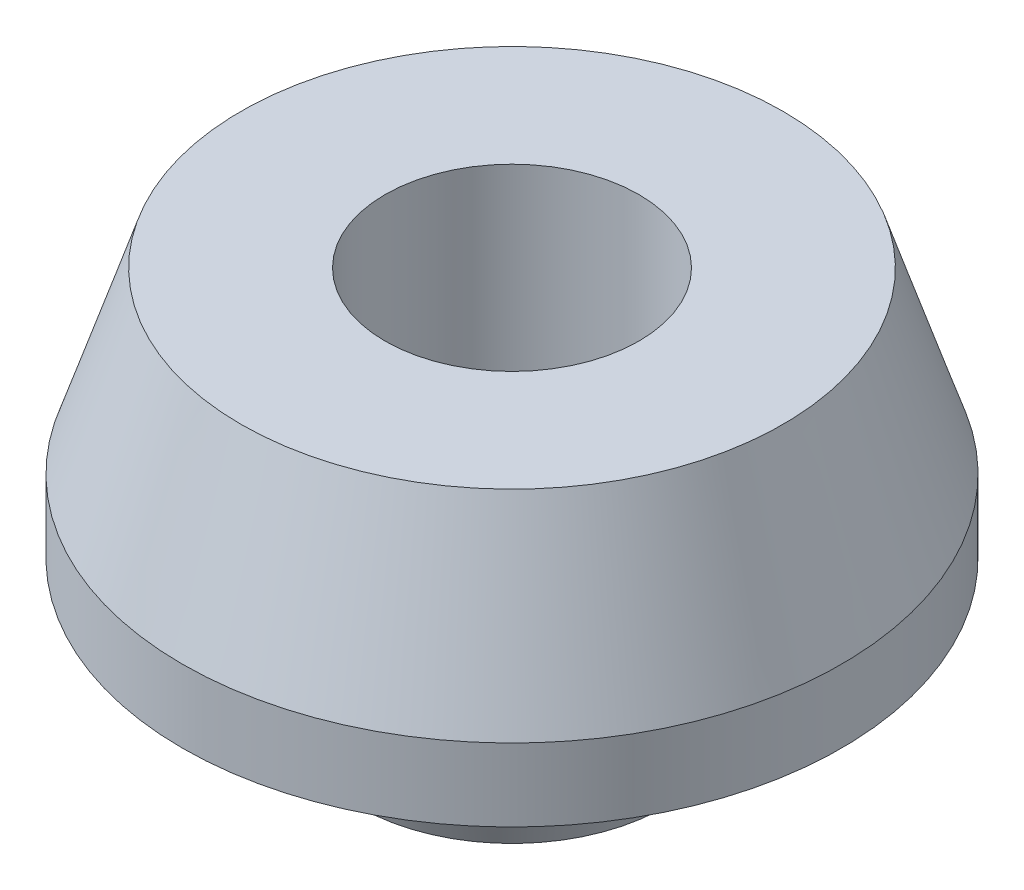
ISO-10303-21;
HEADER;
FILE_DESCRIPTION(('STEP AP214'),'2;1');
FILE_NAME('part.step','',(''),(''),'','','');
FILE_SCHEMA(('AUTOMOTIVE_DESIGN { 1 0 10303 214 1 1 1 1 }'));
ENDSEC;
DATA;
#1=APPLICATION_CONTEXT('core data for automotive mechanical design processes');
#2=APPLICATION_PROTOCOL_DEFINITION('international standard','automotive_design',2000,#1);
#3=PRODUCT_CONTEXT('',#1,'mechanical');
#4=PRODUCT('Part','Part','',(#3));
#5=PRODUCT_RELATED_PRODUCT_CATEGORY('part','',(#4));
#6=PRODUCT_DEFINITION_FORMATION('','',#4);
#7=PRODUCT_DEFINITION_CONTEXT('part definition',#1,'design');
#8=PRODUCT_DEFINITION('design','',#6,#7);
#9=PRODUCT_DEFINITION_SHAPE('','',#8);
#10=(LENGTH_UNIT() NAMED_UNIT(*) SI_UNIT(.MILLI.,.METRE.));
#11=(NAMED_UNIT(*) PLANE_ANGLE_UNIT() SI_UNIT($,.RADIAN.));
#12=(NAMED_UNIT(*) SI_UNIT($,.STERADIAN.) SOLID_ANGLE_UNIT());
#13=UNCERTAINTY_MEASURE_WITH_UNIT(LENGTH_MEASURE(1.E-05),#10,'distance_accuracy_value','');
#14=(GEOMETRIC_REPRESENTATION_CONTEXT(3) GLOBAL_UNCERTAINTY_ASSIGNED_CONTEXT((#13)) GLOBAL_UNIT_ASSIGNED_CONTEXT((#10,
#11,#12)) REPRESENTATION_CONTEXT('',''));
#15=CARTESIAN_POINT('',(0.,0.,0.));
#16=DIRECTION('',(0.,0.,1.));
#17=DIRECTION('',(1.,0.,0.));
#18=AXIS2_PLACEMENT_3D('',#15,#16,#17);
#19=CARTESIAN_POINT('',(5.8,0.,0.));
#20=DIRECTION('',(0.,-1.,0.));
#21=DIRECTION('',(0.,0.,-1.));
#22=AXIS2_PLACEMENT_3D('',#19,#20,#21);
#23=PLANE('',#22);
#24=CARTESIAN_POINT('',(0.,0.,0.));
#25=DIRECTION('',(0.,-1.,0.));
#26=DIRECTION('',(0.,0.,-1.));
#27=AXIS2_PLACEMENT_3D('',#24,#25,#26);
#28=CIRCLE('',#27,5.8);
#29=CARTESIAN_POINT('',(0.,0.,-5.8));
#30=VERTEX_POINT('',#29);
#31=EDGE_CURVE('E55',#30,#30,#28,.T.);
#32=ORIENTED_EDGE('',*,*,#31,.T.);
#33=EDGE_LOOP('',(#32));
#34=FACE_BOUND('',#33,.T.);
#35=CARTESIAN_POINT('',(0.,0.,0.));
#36=DIRECTION('',(0.,-1.,0.));
#37=DIRECTION('',(0.,0.,-1.));
#38=AXIS2_PLACEMENT_3D('',#35,#36,#37);
#39=CIRCLE('',#38,4.8);
#40=CARTESIAN_POINT('',(0.,0.,-4.8));
#41=VERTEX_POINT('',#40);
#42=EDGE_CURVE('E10',#41,#41,#39,.T.);
#43=ORIENTED_EDGE('',*,*,#42,.F.);
#44=EDGE_LOOP('',(#43));
#45=FACE_BOUND('',#44,.T.);
#46=ADVANCED_FACE('F30',(#34,#45),#23,.T.);
#47=CARTESIAN_POINT('',(0.,0.,0.));
#48=DIRECTION('',(0.,-1.,0.));
#49=DIRECTION('',(0.,0.,-1.));
#50=AXIS2_PLACEMENT_3D('',#47,#48,#49);
#51=CYLINDRICAL_SURFACE('',#50,4.8);
#52=ORIENTED_EDGE('',*,*,#42,.T.);
#53=EDGE_LOOP('',(#52));
#54=FACE_BOUND('',#53,.T.);
#55=CARTESIAN_POINT('',(0.,14.75,0.));
#56=DIRECTION('',(0.,-1.,0.));
#57=DIRECTION('',(0.,0.,-1.));
#58=AXIS2_PLACEMENT_3D('',#55,#56,#57);
#59=CIRCLE('',#58,4.8);
#60=CARTESIAN_POINT('',(0.,14.75,-4.8));
#61=VERTEX_POINT('',#60);
#62=EDGE_CURVE('E36',#61,#61,#59,.T.);
#63=ORIENTED_EDGE('',*,*,#62,.F.);
#64=EDGE_LOOP('',(#63));
#65=FACE_BOUND('',#64,.T.);
#66=ADVANCED_FACE('F73',(#54,#65),#51,.F.);
#67=CARTESIAN_POINT('',(4.8,14.75,0.));
#68=DIRECTION('',(0.,1.,0.));
#69=DIRECTION('',(0.,0.,1.));
#70=AXIS2_PLACEMENT_3D('',#67,#68,#69);
#71=PLANE('',#70);
#72=ORIENTED_EDGE('',*,*,#62,.T.);
#73=EDGE_LOOP('',(#72));
#74=FACE_BOUND('',#73,.T.);
#75=CARTESIAN_POINT('',(0.,14.75,0.));
#76=DIRECTION('',(0.,-1.,0.));
#77=DIRECTION('',(0.,0.,-1.));
#78=AXIS2_PLACEMENT_3D('',#75,#76,#77);
#79=CIRCLE('',#78,10.25);
#80=CARTESIAN_POINT('',(0.,14.75,-10.25));
#81=VERTEX_POINT('',#80);
#82=EDGE_CURVE('E40',#81,#81,#79,.T.);
#83=ORIENTED_EDGE('',*,*,#82,.F.);
#84=EDGE_LOOP('',(#83));
#85=FACE_BOUND('',#84,.T.);
#86=ADVANCED_FACE('F77',(#74,#85),#71,.T.);
#87=CARTESIAN_POINT('',(0.,8.,0.));
#88=DIRECTION('',(0.,-1.,0.));
#89=DIRECTION('',(0.,0.,-1.));
#90=AXIS2_PLACEMENT_3D('',#87,#88,#89);
#91=CONICAL_SURFACE('',#90,12.4608437298975,0.316520664516921);
#92=ORIENTED_EDGE('',*,*,#82,.T.);
#93=EDGE_LOOP('',(#92));
#94=FACE_BOUND('',#93,.T.);
#95=CARTESIAN_POINT('',(0.,8.,0.));
#96=DIRECTION('',(0.,-1.,0.));
#97=DIRECTION('',(0.,0.,-1.));
#98=AXIS2_PLACEMENT_3D('',#95,#96,#97);
#99=CIRCLE('',#98,12.4608437298975);
#100=CARTESIAN_POINT('',(0.,8.,-12.4608437298975));
#101=VERTEX_POINT('',#100);
#102=EDGE_CURVE('E44',#101,#101,#99,.T.);
#103=ORIENTED_EDGE('',*,*,#102,.F.);
#104=EDGE_LOOP('',(#103));
#105=FACE_BOUND('',#104,.T.);
#106=ADVANCED_FACE('F81',(#94,#105),#91,.T.);
#107=CARTESIAN_POINT('',(0.,0.,0.));
#108=DIRECTION('',(0.,-1.,0.));
#109=DIRECTION('',(0.,0.,-1.));
#110=AXIS2_PLACEMENT_3D('',#107,#108,#109);
#111=CYLINDRICAL_SURFACE('',#110,12.4608437298975);
#112=ORIENTED_EDGE('',*,*,#102,.T.);
#113=EDGE_LOOP('',(#112));
#114=FACE_BOUND('',#113,.T.);
#115=CARTESIAN_POINT('',(0.,5.25,0.));
#116=DIRECTION('',(0.,-1.,0.));
#117=DIRECTION('',(0.,0.,-1.));
#118=AXIS2_PLACEMENT_3D('',#115,#116,#117);
#119=CIRCLE('',#118,12.4608437298975);
#120=CARTESIAN_POINT('',(0.,5.25,-12.4608437298975));
#121=VERTEX_POINT('',#120);
#122=EDGE_CURVE('E49',#121,#121,#119,.T.);
#123=ORIENTED_EDGE('',*,*,#122,.F.);
#124=EDGE_LOOP('',(#123));
#125=FACE_BOUND('',#124,.T.);
#126=ADVANCED_FACE('F69',(#114,#125),#111,.T.);
#127=CARTESIAN_POINT('',(12.4608437298975,5.25,0.));
#128=DIRECTION('',(0.,-1.,0.));
#129=DIRECTION('',(0.,0.,-1.));
#130=AXIS2_PLACEMENT_3D('',#127,#128,#129);
#131=PLANE('',#130);
#132=ORIENTED_EDGE('',*,*,#122,.T.);
#133=EDGE_LOOP('',(#132));
#134=FACE_BOUND('',#133,.T.);
#135=CARTESIAN_POINT('',(0.,5.25,0.));
#136=DIRECTION('',(0.,-1.,0.));
#137=DIRECTION('',(0.,0.,-1.));
#138=AXIS2_PLACEMENT_3D('',#135,#136,#137);
#139=CIRCLE('',#138,7.71084372989754);
#140=CARTESIAN_POINT('',(0.,5.25,-7.71084372989754));
#141=VERTEX_POINT('',#140);
#142=EDGE_CURVE('E52',#141,#141,#139,.T.);
#143=ORIENTED_EDGE('',*,*,#142,.F.);
#144=EDGE_LOOP('',(#143));
#145=FACE_BOUND('',#144,.T.);
#146=ADVANCED_FACE('F63',(#134,#145),#131,.T.);
#147=CARTESIAN_POINT('',(0.,0.,0.));
#148=DIRECTION('',(0.,1.,0.));
#149=DIRECTION('',(0.,0.,1.));
#150=AXIS2_PLACEMENT_3D('',#147,#148,#149);
#151=CONICAL_SURFACE('',#150,5.8,0.349065850398862);
#152=ORIENTED_EDGE('',*,*,#142,.T.);
#153=EDGE_LOOP('',(#152));
#154=FACE_BOUND('',#153,.T.);
#155=ORIENTED_EDGE('',*,*,#31,.F.);
#156=EDGE_LOOP('',(#155));
#157=FACE_BOUND('',#156,.T.);
#158=ADVANCED_FACE('F61',(#154,#157),#151,.T.);
#159=CLOSED_SHELL('',(#46,#66,#86,#106,#126,#146,#158));
#160=MANIFOLD_SOLID_BREP('B2',#159);
#161=ADVANCED_BREP_SHAPE_REPRESENTATION('',(#18,#160),#14);
#162=SHAPE_DEFINITION_REPRESENTATION(#9,#161);
ENDSEC;
END-ISO-10303-21;
